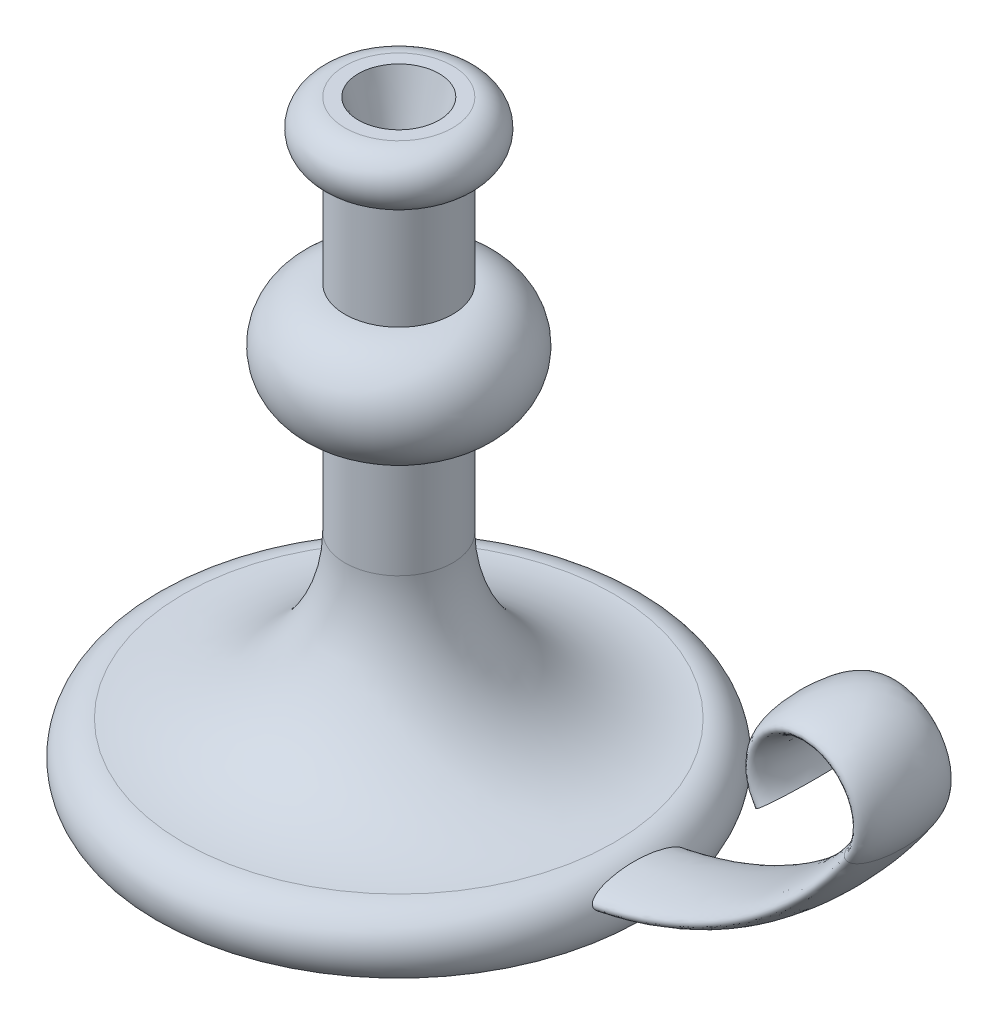
ISO-10303-21;
HEADER;
FILE_DESCRIPTION(('STEP AP214'),'2;1');
FILE_NAME('part.step','',(''),(''),'','','');
FILE_SCHEMA(('AUTOMOTIVE_DESIGN { 1 0 10303 214 1 1 1 1 }'));
ENDSEC;
DATA;
#1=APPLICATION_CONTEXT('core data for automotive mechanical design processes');
#2=APPLICATION_PROTOCOL_DEFINITION('international standard','automotive_design',2000,#1);
#3=PRODUCT_CONTEXT('',#1,'mechanical');
#4=PRODUCT('Part','Part','',(#3));
#5=PRODUCT_RELATED_PRODUCT_CATEGORY('part','',(#4));
#6=PRODUCT_DEFINITION_FORMATION('','',#4);
#7=PRODUCT_DEFINITION_CONTEXT('part definition',#1,'design');
#8=PRODUCT_DEFINITION('design','',#6,#7);
#9=PRODUCT_DEFINITION_SHAPE('','',#8);
#10=(LENGTH_UNIT() NAMED_UNIT(*) SI_UNIT(.MILLI.,.METRE.));
#11=(NAMED_UNIT(*) PLANE_ANGLE_UNIT() SI_UNIT($,.RADIAN.));
#12=(NAMED_UNIT(*) SI_UNIT($,.STERADIAN.) SOLID_ANGLE_UNIT());
#13=UNCERTAINTY_MEASURE_WITH_UNIT(LENGTH_MEASURE(1.E-05),#10,'distance_accuracy_value','');
#14=(GEOMETRIC_REPRESENTATION_CONTEXT(3) GLOBAL_UNCERTAINTY_ASSIGNED_CONTEXT((#13)) GLOBAL_UNIT_ASSIGNED_CONTEXT((#10,
#11,#12)) REPRESENTATION_CONTEXT('',''));
#15=CARTESIAN_POINT('',(0.,0.,0.));
#16=DIRECTION('',(0.,0.,1.));
#17=DIRECTION('',(1.,0.,0.));
#18=AXIS2_PLACEMENT_3D('',#15,#16,#17);
#19=CARTESIAN_POINT('',(0.,0.,0.));
#20=DIRECTION('',(0.,1.,0.));
#21=DIRECTION('',(0.,0.,1.));
#22=AXIS2_PLACEMENT_3D('',#19,#20,#21);
#23=PLANE('',#22);
#24=CARTESIAN_POINT('',(0.,0.,0.));
#25=DIRECTION('',(0.,1.,0.));
#26=DIRECTION('',(0.,0.,1.));
#27=AXIS2_PLACEMENT_3D('',#24,#25,#26);
#28=CIRCLE('',#27,90.);
#29=CARTESIAN_POINT('',(0.,0.,90.));
#30=VERTEX_POINT('',#29);
#31=EDGE_CURVE('E63',#30,#30,#28,.T.);
#32=ORIENTED_EDGE('',*,*,#31,.F.);
#33=EDGE_LOOP('',(#32));
#34=FACE_BOUND('',#33,.T.);
#35=ADVANCED_FACE('F33',(#34),#23,.F.);
#36=CARTESIAN_POINT('',(0.,220.,0.));
#37=DIRECTION('',(0.,-1.,0.));
#38=DIRECTION('',(0.,0.,-1.));
#39=AXIS2_PLACEMENT_3D('',#36,#37,#38);
#40=PLANE('',#39);
#41=CARTESIAN_POINT('',(0.,220.,0.));
#42=DIRECTION('',(0.,1.,0.));
#43=DIRECTION('',(0.,0.,1.));
#44=AXIS2_PLACEMENT_3D('',#41,#42,#43);
#45=CIRCLE('',#44,15.);
#46=CARTESIAN_POINT('',(0.,220.,15.));
#47=VERTEX_POINT('',#46);
#48=EDGE_CURVE('E75',#47,#47,#45,.T.);
#49=ORIENTED_EDGE('',*,*,#48,.F.);
#50=EDGE_LOOP('',(#49));
#51=FACE_BOUND('',#50,.T.);
#52=CARTESIAN_POINT('',(0.,220.,0.));
#53=DIRECTION('',(0.,1.,0.));
#54=DIRECTION('',(0.,0.,1.));
#55=AXIS2_PLACEMENT_3D('',#52,#53,#54);
#56=CIRCLE('',#55,20.);
#57=CARTESIAN_POINT('',(0.,220.,20.));
#58=VERTEX_POINT('',#57);
#59=EDGE_CURVE('E10',#58,#58,#56,.T.);
#60=ORIENTED_EDGE('',*,*,#59,.T.);
#61=EDGE_LOOP('',(#60));
#62=FACE_BOUND('',#61,.T.);
#63=ADVANCED_FACE('F81',(#51,#62),#40,.F.);
#64=CARTESIAN_POINT('',(0.,210.,0.));
#65=DIRECTION('',(0.,1.,0.));
#66=DIRECTION('',(0.,0.,1.));
#67=AXIS2_PLACEMENT_3D('',#64,#65,#66);
#68=TOROIDAL_SURFACE('',#67,20.,10.);
#69=ORIENTED_EDGE('',*,*,#59,.F.);
#70=EDGE_LOOP('',(#69));
#71=FACE_BOUND('',#70,.T.);
#72=CARTESIAN_POINT('',(0.,200.,0.));
#73=DIRECTION('',(0.,1.,0.));
#74=DIRECTION('',(0.,0.,1.));
#75=AXIS2_PLACEMENT_3D('',#72,#73,#74);
#76=CIRCLE('',#75,20.);
#77=CARTESIAN_POINT('',(0.,200.,20.));
#78=VERTEX_POINT('',#77);
#79=EDGE_CURVE('E45',#78,#78,#76,.T.);
#80=ORIENTED_EDGE('',*,*,#79,.T.);
#81=EDGE_LOOP('',(#80));
#82=FACE_BOUND('',#81,.T.);
#83=ADVANCED_FACE('F83',(#71,#82),#68,.T.);
#84=CARTESIAN_POINT('',(0.,0.,0.));
#85=DIRECTION('',(0.,1.,0.));
#86=DIRECTION('',(0.,0.,1.));
#87=AXIS2_PLACEMENT_3D('',#84,#85,#86);
#88=CYLINDRICAL_SURFACE('',#87,20.);
#89=ORIENTED_EDGE('',*,*,#79,.F.);
#90=EDGE_LOOP('',(#89));
#91=FACE_BOUND('',#90,.T.);
#92=CARTESIAN_POINT('',(0.,160.,0.));
#93=DIRECTION('',(0.,1.,0.));
#94=DIRECTION('',(0.,0.,1.));
#95=AXIS2_PLACEMENT_3D('',#92,#93,#94);
#96=CIRCLE('',#95,20.);
#97=CARTESIAN_POINT('',(0.,160.,20.));
#98=VERTEX_POINT('',#97);
#99=EDGE_CURVE('E49',#98,#98,#96,.T.);
#100=ORIENTED_EDGE('',*,*,#99,.T.);
#101=EDGE_LOOP('',(#100));
#102=FACE_BOUND('',#101,.T.);
#103=ADVANCED_FACE('F89',(#91,#102),#88,.T.);
#104=CARTESIAN_POINT('',(0.,140.,0.));
#105=DIRECTION('',(0.,1.,0.));
#106=DIRECTION('',(0.,0.,1.));
#107=AXIS2_PLACEMENT_3D('',#104,#105,#106);
#108=TOROIDAL_SURFACE('',#107,20.,20.);
#109=ORIENTED_EDGE('',*,*,#99,.F.);
#110=EDGE_LOOP('',(#109));
#111=FACE_BOUND('',#110,.T.);
#112=CARTESIAN_POINT('',(0.,120.,0.));
#113=DIRECTION('',(0.,1.,0.));
#114=DIRECTION('',(0.,0.,1.));
#115=AXIS2_PLACEMENT_3D('',#112,#113,#114);
#116=CIRCLE('',#115,20.);
#117=CARTESIAN_POINT('',(0.,120.,20.));
#118=VERTEX_POINT('',#117);
#119=EDGE_CURVE('E54',#118,#118,#116,.T.);
#120=ORIENTED_EDGE('',*,*,#119,.T.);
#121=EDGE_LOOP('',(#120));
#122=FACE_BOUND('',#121,.T.);
#123=ADVANCED_FACE('F97',(#111,#122),#108,.T.);
#124=CARTESIAN_POINT('',(0.,0.,0.));
#125=DIRECTION('',(0.,1.,0.));
#126=DIRECTION('',(0.,0.,1.));
#127=AXIS2_PLACEMENT_3D('',#124,#125,#126);
#128=CYLINDRICAL_SURFACE('',#127,20.);
#129=ORIENTED_EDGE('',*,*,#119,.F.);
#130=EDGE_LOOP('',(#129));
#131=FACE_BOUND('',#130,.T.);
#132=CARTESIAN_POINT('',(0.,80.,0.));
#133=DIRECTION('',(0.,1.,0.));
#134=DIRECTION('',(0.,0.,1.));
#135=AXIS2_PLACEMENT_3D('',#132,#133,#134);
#136=CIRCLE('',#135,20.);
#137=CARTESIAN_POINT('',(0.,80.,20.));
#138=VERTEX_POINT('',#137);
#139=EDGE_CURVE('E57',#138,#138,#136,.T.);
#140=ORIENTED_EDGE('',*,*,#139,.T.);
#141=EDGE_LOOP('',(#140));
#142=FACE_BOUND('',#141,.T.);
#143=ADVANCED_FACE('F101',(#131,#142),#128,.T.);
#144=CARTESIAN_POINT('',(0.,80.,0.));
#145=DIRECTION('',(0.,1.,0.));
#146=DIRECTION('',(0.,0.,1.));
#147=AXIS2_PLACEMENT_3D('',#144,#145,#146);
#148=TOROIDAL_SURFACE('',#147,80.,60.);
#149=ORIENTED_EDGE('',*,*,#139,.F.);
#150=EDGE_LOOP('',(#149));
#151=FACE_BOUND('',#150,.T.);
#152=CARTESIAN_POINT('',(0.,20.,0.));
#153=DIRECTION('',(0.,1.,0.));
#154=DIRECTION('',(0.,0.,1.));
#155=AXIS2_PLACEMENT_3D('',#152,#153,#154);
#156=CIRCLE('',#155,80.);
#157=CARTESIAN_POINT('',(0.,20.,80.));
#158=VERTEX_POINT('',#157);
#159=EDGE_CURVE('E60',#158,#158,#156,.T.);
#160=ORIENTED_EDGE('',*,*,#159,.T.);
#161=EDGE_LOOP('',(#160));
#162=FACE_BOUND('',#161,.T.);
#163=ADVANCED_FACE('F105',(#151,#162),#148,.F.);
#164=CARTESIAN_POINT('',(0.,7.49999999999999,0.));
#165=DIRECTION('',(0.,1.,0.));
#166=DIRECTION('',(0.,0.,1.));
#167=AXIS2_PLACEMENT_3D('',#164,#165,#166);
#168=TOROIDAL_SURFACE('',#167,80.,12.5);
#169=CARTESIAN_POINT('',(89.5597422043342,12.9414346567555,-17.5));
#170=CARTESIAN_POINT('',(89.5807278946485,12.8988393157081,-17.5000019534777));
#171=CARTESIAN_POINT('',(89.6018125795404,12.8563039357769,-17.4977816975197));
#172=CARTESIAN_POINT('',(89.6440155813562,12.771693833937,-17.489002543543));
#173=CARTESIAN_POINT('',(89.6651339056646,12.7296192360718,-17.4824425050804));
#174=CARTESIAN_POINT('',(89.7283289297819,12.6045076597417,-17.4565216692094));
#175=CARTESIAN_POINT('',(89.7702246464786,12.5226255894255,-17.4309204730636));
#176=CARTESIAN_POINT('',(89.8644276523312,12.3407735771966,-17.3563532007827));
#177=CARTESIAN_POINT('',(89.9162117483189,12.242484901666,-17.3027527423027));
#178=CARTESIAN_POINT('',(90.01638786814,12.0551458272008,-17.178826321144));
#179=CARTESIAN_POINT('',(90.0647710548456,11.966119226993,-17.1084587296403));
#180=CARTESIAN_POINT('',(90.1524531790238,11.8069845229249,-16.9652391551481));
#181=CARTESIAN_POINT('',(90.1921458014336,11.7358878994478,-16.8936963434585));
#182=CARTESIAN_POINT('',(90.2690886261224,11.5996259068224,-16.7438969488311));
#183=CARTESIAN_POINT('',(90.3063367280021,11.5344656201532,-16.665634722265));
#184=CARTESIAN_POINT('',(90.3786756485819,11.4092540815105,-16.5039763875564));
#185=CARTESIAN_POINT('',(90.4137624747614,11.349212210629,-16.4205713158719));
#186=CARTESIAN_POINT('',(90.4819450166471,11.2336894025401,-16.2499454917114));
#187=CARTESIAN_POINT('',(90.5150413047902,11.1782071523834,-16.162725848809));
#188=CARTESIAN_POINT('',(90.5839705930101,11.0637251825689,-15.9728919395736));
#189=CARTESIAN_POINT('',(90.6195406839563,11.0053156128849,-15.8698282905887));
#190=CARTESIAN_POINT('',(90.6886668526269,10.8929143897208,-15.6606649910658));
#191=CARTESIAN_POINT('',(90.7222226971282,10.8389232475745,-15.5545649910506));
#192=CARTESIAN_POINT('',(90.7874864861339,10.7348751403119,-15.3401290691865));
#193=CARTESIAN_POINT('',(90.8191972688173,10.6848120890841,-15.2317969483067));
#194=CARTESIAN_POINT('',(90.881005962979,10.5880683385414,-15.0131968985225));
#195=CARTESIAN_POINT('',(90.9111039714557,10.5413874357516,-14.9029290865686));
#196=CARTESIAN_POINT('',(90.9798973633521,10.4355491517098,-14.6427529331226));
#197=CARTESIAN_POINT('',(91.0180072010883,10.377593665576,-14.492201207548));
#198=CARTESIAN_POINT('',(91.0918875553169,10.2663462891691,-14.1888070722871));
#199=CARTESIAN_POINT('',(91.1276577411367,10.2130550577559,-14.0359643425397));
#200=CARTESIAN_POINT('',(91.1971197458645,10.1105127689612,-13.7282685712581));
#201=CARTESIAN_POINT('',(91.2308091946811,10.0612662985098,-13.573413471871));
#202=CARTESIAN_POINT('',(91.2962483962878,9.96642044574796,-13.262180104172));
#203=CARTESIAN_POINT('',(91.3279980241889,9.9208212981999,-13.1058017385396));
#204=CARTESIAN_POINT('',(91.4205951755327,9.78887458660796,-12.6346162266684));
#205=CARTESIAN_POINT('',(91.4787589060981,9.70742476979592,-12.3179025042442));
#206=CARTESIAN_POINT('',(91.5890957852254,9.55493826130149,-11.6792188898601));
#207=CARTESIAN_POINT('',(91.641236506382,9.48395741425904,-11.3572303186109));
#208=CARTESIAN_POINT('',(91.7397682682944,9.35136221163195,-10.7107316640822));
#209=CARTESIAN_POINT('',(91.7861636672357,9.28974074823244,-10.3862236929833));
#210=CARTESIAN_POINT('',(91.8736976604511,9.17463718318051,-9.73512886653562));
#211=CARTESIAN_POINT('',(91.9148370779327,9.12115380666534,-9.40854234516807));
#212=CARTESIAN_POINT('',(91.9930777751443,9.02031209920315,-8.74630339912605));
#213=CARTESIAN_POINT('',(92.0300669877613,8.97311921137157,-8.41061269264328));
#214=CARTESIAN_POINT('',(92.0991833927575,8.88559842477432,-7.73783252743936));
#215=CARTESIAN_POINT('',(92.1313104056235,8.8452707794675,-7.40074301754602));
#216=CARTESIAN_POINT('',(92.1909161961866,8.77092313439267,-6.72537142355336));
#217=CARTESIAN_POINT('',(92.2183937480205,8.73690479789181,-6.38708904887181));
#218=CARTESIAN_POINT('',(92.2688480816039,8.674768403045,-5.7096442777428));
#219=CARTESIAN_POINT('',(92.2918247141674,8.64665054027192,-5.37048185250289));
#220=CARTESIAN_POINT('',(92.3540877228586,8.57076604630486,-4.35367181244658));
#221=CARTESIAN_POINT('',(92.3868571977359,8.53128338370554,-3.67498389641636));
#222=CARTESIAN_POINT('',(92.4356134743347,8.47274161832895,-2.31614711504058));
#223=CARTESIAN_POINT('',(92.4515998737813,8.45368300509715,-1.63599821506812));
#224=CARTESIAN_POINT('',(92.4661200478781,8.43637339284854,-0.357955102331839));
#225=CARTESIAN_POINT('',(92.4665389208555,8.43587490179707,0.239888856143747));
#226=CARTESIAN_POINT('',(92.4546362797528,8.4500624126083,1.4353615385917));
#227=CARTESIAN_POINT('',(92.4423128974783,8.46475064105844,2.03299021814846));
#228=CARTESIAN_POINT('',(92.4047541650815,8.50976680779929,3.22745109478545));
#229=CARTESIAN_POINT('',(92.379514731688,8.54009969200437,3.82428298010724));
#230=CARTESIAN_POINT('',(92.3157217367252,8.61743320229675,5.01694606233257));
#231=CARTESIAN_POINT('',(92.2771508465328,8.66445552395918,5.61277493756125));
#232=CARTESIAN_POINT('',(92.1861026743767,8.77678784246254,6.80153886380931));
#233=CARTESIAN_POINT('',(92.1336290020919,8.84209309262497,7.3944746253508));
#234=CARTESIAN_POINT('',(92.0437550848419,8.95574227206709,8.280552298205));
#235=CARTESIAN_POINT('',(92.0119455213755,8.99622894552012,8.57528682166713));
#236=CARTESIAN_POINT('',(91.9444204496405,9.08291539794886,9.16346094428869));
#237=CARTESIAN_POINT('',(91.9087051114865,9.12911492811455,9.45690059926699));
#238=CARTESIAN_POINT('',(91.8331309715698,9.22782929334065,10.0422906036682));
#239=CARTESIAN_POINT('',(91.7932707518514,9.28034629056378,10.3342404073466));
#240=CARTESIAN_POINT('',(91.709117916737,9.39245062081626,10.916185281105));
#241=CARTESIAN_POINT('',(91.6648247441272,9.45203884286026,11.206180100545));
#242=CARTESIAN_POINT('',(91.5713925727481,9.57931645333874,11.7838191658166));
#243=CARTESIAN_POINT('',(91.5222504482682,9.64701107336918,12.071461764307));
#244=CARTESIAN_POINT('',(91.4186796874406,9.79172730085898,12.6430805537629));
#245=CARTESIAN_POINT('',(91.3642572573635,9.86873798424087,12.9270606150352));
#246=CARTESIAN_POINT('',(91.2493765391175,10.0339529747879,13.4904217181463));
#247=CARTESIAN_POINT('',(91.1889212109098,10.1221517983453,13.7698049377445));
#248=CARTESIAN_POINT('',(91.0929373870874,10.2648274882362,14.1839125047643));
#249=CARTESIAN_POINT('',(91.0600757486262,10.3140904181848,14.3210581267384));
#250=CARTESIAN_POINT('',(90.9923938569387,10.4165511027191,14.5933763477646));
#251=CARTESIAN_POINT('',(90.9575737807137,10.4697485018482,14.7285491237341));
#252=CARTESIAN_POINT('',(90.8810851838777,10.5878451344078,15.0138774923675));
#253=CARTESIAN_POINT('',(90.8391147723957,10.6533666208411,15.1636969104746));
#254=CARTESIAN_POINT('',(90.7519625692612,10.7912189771814,15.4593295355899));
#255=CARTESIAN_POINT('',(90.7067794219569,10.8635527258307,15.6051410149848));
#256=CARTESIAN_POINT('',(90.6128939496975,11.0160439629677,15.8905749729622));
#257=CARTESIAN_POINT('',(90.5642084544311,11.0961646105685,16.0302224467125));
#258=CARTESIAN_POINT('',(90.4624897667353,11.2662530107873,16.3016394850687));
#259=CARTESIAN_POINT('',(90.4094613083908,11.3562100760682,16.4334173639364));
#260=CARTESIAN_POINT('',(90.3114276481005,11.5255085385048,16.655310813896));
#261=CARTESIAN_POINT('',(90.2675273757817,11.6022608890606,16.7478644471361));
#262=CARTESIAN_POINT('',(90.1761749534326,11.7643292238687,16.9236630994732));
#263=CARTESIAN_POINT('',(90.1287172073378,11.849658775493,17.0068929161981));
#264=CARTESIAN_POINT('',(90.0292807633426,12.0313291797368,17.160728121925));
#265=CARTESIAN_POINT('',(89.9772518064337,12.1277974407354,17.2311575389091));
#266=CARTESIAN_POINT('',(89.8965437818878,12.2800613987941,17.3212876850735));
#267=CARTESIAN_POINT('',(89.8692277989253,12.3320164153136,17.3487242132161));
#268=CARTESIAN_POINT('',(89.8138320311432,12.4382955168477,17.3975211145679));
#269=CARTESIAN_POINT('',(89.7857527202502,12.4926181439797,17.418885167671));
#270=CARTESIAN_POINT('',(89.7185869780336,12.6237048005598,17.4611772226903));
#271=CARTESIAN_POINT('',(89.6792533408887,12.7013692224275,17.4790502108363));
#272=CARTESIAN_POINT('',(89.6005512815565,12.8586256339484,17.4997317533412));
#273=CARTESIAN_POINT('',(89.5611829132234,12.9382160139948,17.5025524785485));
#274=CARTESIAN_POINT('',(89.4835317885698,13.0969633423243,17.4927372657774));
#275=CARTESIAN_POINT('',(89.4452490812937,13.1761202708963,17.4801006306501));
#276=CARTESIAN_POINT('',(89.3707047667355,13.3318071774562,17.440649407729));
#277=CARTESIAN_POINT('',(89.3344452993772,13.408334342353,17.413820111618));
#278=CARTESIAN_POINT('',(89.2510611220235,13.5858554385681,17.3357126521073));
#279=CARTESIAN_POINT('',(89.2050998650832,13.6849823777219,17.2790047620842));
#280=CARTESIAN_POINT('',(89.1180744174557,13.8744276311818,17.1491670423827));
#281=CARTESIAN_POINT('',(89.077030105826,13.9647099356685,17.0759737821299));
#282=CARTESIAN_POINT('',(89.0037033744712,14.1271434857569,16.9270577307041));
#283=CARTESIAN_POINT('',(88.9709541551904,14.200194568073,16.8525208708988));
#284=CARTESIAN_POINT('',(88.9084968426191,14.3401811690447,16.6970292692113));
#285=CARTESIAN_POINT('',(88.8787841266135,14.4071259665768,16.6160846261895));
#286=CARTESIAN_POINT('',(88.821781438855,14.5359995630881,16.4490709627681));
#287=CARTESIAN_POINT('',(88.7944998605827,14.597910924241,16.3629857823213));
#288=CARTESIAN_POINT('',(88.742066743737,14.7171734064658,16.1870697873634));
#289=CARTESIAN_POINT('',(88.7169159331093,14.7745229686599,16.0972377082954));
#290=CARTESIAN_POINT('',(88.6682699235337,14.885589909051,15.9140699306466));
#291=CARTESIAN_POINT('',(88.6447869137157,14.9392804489424,15.8207148279063));
#292=CARTESIAN_POINT('',(88.5993971939428,15.043100884388,15.6316626961438));
#293=CARTESIAN_POINT('',(88.5774907604159,15.09323015551,15.5359652603529));
#294=CARTESIAN_POINT('',(88.5137514786221,15.2390285874184,15.2458062448793));
#295=CARTESIAN_POINT('',(88.4739596847914,15.3299685477357,15.0485147207853));
#296=CARTESIAN_POINT('',(88.3985337506616,15.5017775203623,14.6487152633395));
#297=CARTESIAN_POINT('',(88.3629029634841,15.5826384140038,14.4462032813481));
#298=CARTESIAN_POINT('',(88.2948356711213,15.7363066128669,14.0365764701698));
#299=CARTESIAN_POINT('',(88.262414229517,15.8090761199813,13.8294450545359));
#300=CARTESIAN_POINT('',(88.2003835751383,15.9473648801954,13.412628987177));
#301=CARTESIAN_POINT('',(88.1707714189815,16.012891733822,13.2029472733592));
#302=CARTESIAN_POINT('',(88.1139049361939,16.1377375745618,12.7814949946311));
#303=CARTESIAN_POINT('',(88.0866500408509,16.1970580597501,12.5697249473639));
#304=CARTESIAN_POINT('',(88.0276172572031,16.3244235662302,12.0912931700789));
#305=CARTESIAN_POINT('',(87.9964138193045,16.3909381265492,11.8241540502356));
#306=CARTESIAN_POINT('',(87.9367717636618,16.5165936764717,11.2878278414661));
#307=CARTESIAN_POINT('',(87.9083334164423,16.5757339447658,11.0186405549286));
#308=CARTESIAN_POINT('',(87.8539266282973,16.6875098948954,10.4785408424896));
#309=CARTESIAN_POINT('',(87.8279593730488,16.7401424577993,10.2076276543206));
#310=CARTESIAN_POINT('',(87.7783184309333,16.8395301522934,9.66451167999969));
#311=CARTESIAN_POINT('',(87.7546448506397,16.8862850108115,9.39230883454069));
#312=CARTESIAN_POINT('',(87.6869994555326,17.0182803050946,8.57578965921947));
#313=CARTESIAN_POINT('',(87.6462388525848,17.0955854003685,8.0299116722562));
#314=CARTESIAN_POINT('',(87.5728065515612,17.23201456873,6.93552385094184));
#315=CARTESIAN_POINT('',(87.5401330675684,17.2911426566326,6.38701462498281));
#316=CARTESIAN_POINT('',(87.4828441952972,17.3930876120973,5.28955884851114));
#317=CARTESIAN_POINT('',(87.4582074588682,17.4359477429321,4.74061740412776));
#318=CARTESIAN_POINT('',(87.4169410999173,17.50688849347,3.64146108218984));
#319=CARTESIAN_POINT('',(87.4003119088603,17.5349683167838,3.09124613762086));
#320=CARTESIAN_POINT('',(87.375169948199,17.5771566462024,1.98980868969536));
#321=CARTESIAN_POINT('',(87.3666614689744,17.5912577671531,1.43858580772459));
#322=CARTESIAN_POINT('',(87.3578539704596,17.6058511840595,0.335909067649123));
#323=CARTESIAN_POINT('',(87.3575547550007,17.6063438052041,-0.2155447846214));
#324=CARTESIAN_POINT('',(87.3651677510508,17.5937352162514,-1.31815822775828));
#325=CARTESIAN_POINT('',(87.3730787250643,17.5806360547997,-1.86931785044668));
#326=CARTESIAN_POINT('',(87.3970372477741,17.5404868292748,-2.97097544677276));
#327=CARTESIAN_POINT('',(87.4130850653536,17.5134363041763,-3.5214733979428));
#328=CARTESIAN_POINT('',(87.4531996813079,17.4446213827579,-4.62112135666312));
#329=CARTESIAN_POINT('',(87.4772644593789,17.4028606933023,-5.17027166873653));
#330=CARTESIAN_POINT('',(87.5333316774058,17.3033707612736,-6.26670053623022));
#331=CARTESIAN_POINT('',(87.5653334299479,17.2456429015522,-6.81397924958862));
#332=CARTESIAN_POINT('',(87.6208220531228,17.1429049509091,-7.65503321383248));
#333=CARTESIAN_POINT('',(87.6414679669256,17.1042333246747,-7.94978028808389));
#334=CARTESIAN_POINT('',(87.6851649593453,17.0212250701561,-8.53829462761755));
#335=CARTESIAN_POINT('',(87.7082159678747,16.9768886069434,-8.83206192119445));
#336=CARTESIAN_POINT('',(87.7568106691334,16.8820510369686,-9.41827197236465));
#337=CARTESIAN_POINT('',(87.7823533405998,16.8315524537752,-9.71071522164428));
#338=CARTESIAN_POINT('',(87.8360989952262,16.7237193681056,-10.2940938312713));
#339=CARTESIAN_POINT('',(87.8643018909553,16.6663850902748,-10.585029240844));
#340=CARTESIAN_POINT('',(87.9147712499544,16.5622842610512,-11.078452988719));
#341=CARTESIAN_POINT('',(87.9362980252951,16.5174691899797,-11.2814293835303));
#342=CARTESIAN_POINT('',(87.98091183013,16.4236835134758,-11.6862455623045));
#343=CARTESIAN_POINT('',(88.003998812335,16.374713033981,-11.8880853805162));
#344=CARTESIAN_POINT('',(88.051919824494,16.2721215384767,-12.2905621648816));
#345=CARTESIAN_POINT('',(88.0767553337321,16.2184965755437,-12.4911979528386));
#346=CARTESIAN_POINT('',(88.1283787004664,16.1060707847346,-12.8907612736812));
#347=CARTESIAN_POINT('',(88.1551664933019,16.0472701282671,-13.0896888628995));
#348=CARTESIAN_POINT('',(88.21099997805,15.9237718205584,-13.4854201231387));
#349=CARTESIAN_POINT('',(88.2400459194855,15.8590735174972,-13.6822235566987));
#350=CARTESIAN_POINT('',(88.3008027999429,15.722869193586,-14.0730419872875));
#351=CARTESIAN_POINT('',(88.3325134779581,15.6513638393852,-14.2670572552379));
#352=CARTESIAN_POINT('',(88.3991424541956,15.5003948115867,-14.6511973591117));
#353=CARTESIAN_POINT('',(88.4340575115813,15.4209391715434,-14.8413258930641));
#354=CARTESIAN_POINT('',(88.5079196083045,15.2523848762573,-15.2164401400152));
#355=CARTESIAN_POINT('',(88.5468648114126,15.1632906117658,-15.4014281468474));
#356=CARTESIAN_POINT('',(88.6092096238848,15.0206579718878,-15.6733114229628));
#357=CARTESIAN_POINT('',(88.6306485895098,14.9716086740033,-15.7630166800357));
#358=CARTESIAN_POINT('',(88.6750422753309,14.8701248615228,-15.9401002079361));
#359=CARTESIAN_POINT('',(88.6979967332494,14.8176909327206,-16.0274788777588));
#360=CARTESIAN_POINT('',(88.7456840101796,14.708947884428,-16.1993887567124));
#361=CARTESIAN_POINT('',(88.7704179688268,14.6526362825898,-16.2839180892534));
#362=CARTESIAN_POINT('',(88.8219484857477,14.535642261791,-16.4492391224747));
#363=CARTESIAN_POINT('',(88.8487445345046,14.4749609227749,-16.5300317386025));
#364=CARTESIAN_POINT('',(88.8976102788186,14.3647434848953,-16.6667168433045));
#365=CARTESIAN_POINT('',(88.9191374191608,14.3163230322084,-16.723695533494));
#366=CARTESIAN_POINT('',(88.9637080676467,14.2164452982163,-16.8342912802669));
#367=CARTESIAN_POINT('',(88.9867519478512,14.1649872721067,-16.8879075056812));
#368=CARTESIAN_POINT('',(89.0583610181499,14.0058008216802,-17.0423310846551));
#369=CARTESIAN_POINT('',(89.1095289234102,13.8929758416962,-17.137079610972));
#370=CARTESIAN_POINT('',(89.1999001554573,13.696338620898,-17.2707956184661));
#371=CARTESIAN_POINT('',(89.236750516932,13.6167644879688,-17.3175503480627));
#372=CARTESIAN_POINT('',(89.3136877653848,13.4522974166017,-17.3968468737184));
#373=CARTESIAN_POINT('',(89.3537667767863,13.367417527397,-17.4294220837179));
#374=CARTESIAN_POINT('',(89.4217091217891,13.2251848973546,-17.4685967336682));
#375=CARTESIAN_POINT('',(89.4488093840978,13.168855171618,-17.4803204652975));
#376=CARTESIAN_POINT('',(89.5037947740348,13.0554594934973,-17.4960211898048));
#377=CARTESIAN_POINT('',(89.5316799818999,12.9983934661742,-17.499997387795));
#378=CARTESIAN_POINT('',(89.5597422043342,12.9414346567555,-17.5));
#379=B_SPLINE_CURVE_WITH_KNOTS('',3,(#169,#170,#171,#172,#173,#174,#175,#176,#177,#178,#179,
#180,#181,#182,#183,#184,#185,#186,#187,#188,#189,#190,#191,#192,#193,#194,#195,#196,#197,#198,
#199,#200,#201,#202,#203,#204,#205,#206,#207,#208,#209,#210,#211,#212,#213,#214,#215,#216,#217,
#218,#219,#220,#221,#222,#223,#224,#225,#226,#227,#228,#229,#230,#231,#232,#233,#234,#235,#236,
#237,#238,#239,#240,#241,#242,#243,#244,#245,#246,#247,#248,#249,#250,#251,#252,#253,#254,#255,
#256,#257,#258,#259,#260,#261,#262,#263,#264,#265,#266,#267,#268,#269,#270,#271,#272,#273,#274,
#275,#276,#277,#278,#279,#280,#281,#282,#283,#284,#285,#286,#287,#288,#289,#290,#291,#292,#293,
#294,#295,#296,#297,#298,#299,#300,#301,#302,#303,#304,#305,#306,#307,#308,#309,#310,#311,#312,
#313,#314,#315,#316,#317,#318,#319,#320,#321,#322,#323,#324,#325,#326,#327,#328,#329,#330,#331,
#332,#333,#334,#335,#336,#337,#338,#339,#340,#341,#342,#343,#344,#345,#346,#347,#348,#349,#350,
#351,#352,#353,#354,#355,#356,#357,#358,#359,#360,#361,#362,#363,#364,#365,#366,#367,#368,#369,
#370,#371,#372,#373,#374,#375,#376,#377,#378),.UNSPECIFIED.,.T.,.F.,(4,2,2,2,2,2,2,2,2,2,2,2,2,
2,2,2,2,2,2,2,2,2,2,2,2,2,2,2,2,2,2,2,2,2,2,2,2,2,2,2,2,2,2,2,2,2,2,2,2,2,2,2,2,2,2,2,2,2,2,2,2,
2,2,2,2,2,2,2,2,2,2,2,2,2,2,2,2,2,2,2,2,2,2,2,2,2,2,2,2,2,2,2,2,2,2,2,2,2,2,2,2,2,2,2,4),(0.,
0.142381357158824,0.284800145338814,0.569778369710406,0.937790990160525,1.30672699797604,
1.63143353328554,1.95641550824171,2.28198085179476,2.60745211744531,2.97835758825749,
3.34930592253145,3.71966767593577,4.09000712931068,4.58717127025781,5.08440552627607,
5.58219609730425,6.0800186832221,7.07612740491155,8.07737111401425,9.07785060328487,
10.0781732018631,11.1010679437463,12.124000441837,13.1472022244408,14.1704379160044,
16.2117115539475,18.2530341182274,20.046245769242,21.8397203676841,23.6337623045227,
25.4301450150664,27.2260617741973,28.1235892294176,29.0210776087002,29.9188740333845,
30.816783451432,31.7152755049918,32.6127240115715,33.5097343419001,33.9578247270812,
34.4058746792326,34.9121604747936,35.4186611861168,35.9228725276492,36.4265413835619,
36.8100240505596,37.1941231504199,37.5831580539591,37.7772586450041,37.9712413599167,
38.2366258142316,38.5017956533799,38.7669774525069,39.0324346081147,39.3996555983547,
39.7683144393119,40.0959866375237,40.4231523204125,40.7514069982209,41.0797733710073,
41.4103344436375,41.7409533344648,42.4030339566264,43.0656444835725,43.7312306850942,
44.3961116446145,45.0608317450492,45.8918608553065,46.7229711882485,47.554478313974,
48.3860240564132,50.0440426041155,51.7016946762987,53.3549069476158,55.0082082878421,
56.66238262673,58.3165174374141,59.9704029618881,61.6243431428158,63.2778668395586,
64.9312473761617,65.825161771736,66.719050124865,67.6125736254172,68.5060677696803,
69.1329546330635,69.7598225042264,70.3872272415065,71.0146112082189,71.6420645989491,
72.2694566030637,72.8962209263431,73.5227009279498,73.8360175198378,74.1492800292287,
74.4627449766586,74.7761327179486,75.0094189443185,75.2427626113335,75.708018639221,
76.0052441465106,76.3017654013234,76.4921392885515,76.6825327068869),.UNSPECIFIED.);
#380=CARTESIAN_POINT('',(89.5597422043342,12.9414346567555,-17.5));
#381=VERTEX_POINT('',#380);
#382=EDGE_CURVE('E36',#381,#381,#379,.T.);
#383=ORIENTED_EDGE('',*,*,#382,.T.);
#384=EDGE_LOOP('',(#383));
#385=FACE_BOUND('',#384,.T.);
#386=ORIENTED_EDGE('',*,*,#159,.F.);
#387=EDGE_LOOP('',(#386));
#388=FACE_BOUND('',#387,.T.);
#389=ORIENTED_EDGE('',*,*,#31,.T.);
#390=EDGE_LOOP('',(#389));
#391=FACE_BOUND('',#390,.T.);
#392=ADVANCED_FACE('F108',(#385,#388,#391),#168,.T.);
#393=CARTESIAN_POINT('',(60.,10.,-17.5));
#394=CARTESIAN_POINT('',(110.410191303973,10.,-17.5));
#395=CARTESIAN_POINT('',(155.026295870831,33.4646670673665,-17.5));
#396=CARTESIAN_POINT('',(183.592070943083,75.,-17.5));
#397=CARTESIAN_POINT('',(60.,20.,-17.5));
#398=CARTESIAN_POINT('',(107.049511883708,20.,-17.5));
#399=CARTESIAN_POINT('',(148.691209479443,41.9003559295421,-17.5));
#400=CARTESIAN_POINT('',(175.352599546877,80.6666666666666,-17.5));
#401=CARTESIAN_POINT('',(60.,20.,17.5));
#402=CARTESIAN_POINT('',(107.049511883708,20.,17.5));
#403=CARTESIAN_POINT('',(148.691209479443,41.9003559295421,17.5));
#404=CARTESIAN_POINT('',(175.352599546877,80.6666666666666,17.5));
#405=CARTESIAN_POINT('',(60.,10.,17.5));
#406=CARTESIAN_POINT('',(110.410191303973,10.,17.5));
#407=CARTESIAN_POINT('',(155.026295870831,33.4646670673665,17.5));
#408=CARTESIAN_POINT('',(183.592070943083,75.,17.5));
#409=CARTESIAN_POINT('',(60.,0.,17.5));
#410=CARTESIAN_POINT('',(113.770870724238,0.,17.5));
#411=CARTESIAN_POINT('',(161.36138226222,25.0289782051909,17.5));
#412=CARTESIAN_POINT('',(191.831542339288,69.3333333333333,17.5));
#413=CARTESIAN_POINT('',(60.,0.,-17.5));
#414=CARTESIAN_POINT('',(113.770870724238,0.,-17.5));
#415=CARTESIAN_POINT('',(161.36138226222,25.0289782051909,-17.5));
#416=CARTESIAN_POINT('',(191.831542339288,69.3333333333333,-17.5));
#417=CARTESIAN_POINT('',(60.,10.,-17.5));
#418=CARTESIAN_POINT('',(110.410191303973,10.,-17.5));
#419=CARTESIAN_POINT('',(155.026295870831,33.4646670673665,-17.5));
#420=CARTESIAN_POINT('',(183.592070943083,75.,-17.5));
#421=(BOUNDED_SURFACE() B_SPLINE_SURFACE(3,3,((#393,#394,#395,#396),(#397,#398,#399,#400),(#401,
#402,#403,#404),(#405,#406,#407,#408),(#409,#410,#411,#412),(#413,#414,#415,#416),(#417,#418,
#419,#420)),.UNSPECIFIED.,.T.,.F.,.F.) B_SPLINE_SURFACE_WITH_KNOTS((4,3,4),(4,4),(0.,0.5,1.),
(0.,1.),.UNSPECIFIED.) GEOMETRIC_REPRESENTATION_ITEM() RATIONAL_B_SPLINE_SURFACE(((1.,
0.923374135437856,0.923374135437856,1.),(0.333333333333333,0.307791378479285,0.307791378479285,
0.333333333333333),(0.333333333333333,0.307791378479285,0.307791378479285,0.333333333333333),
(1.,0.923374135437856,0.923374135437856,1.),(0.333333333333333,0.307791378479285,
0.307791378479285,0.333333333333333),(0.333333333333333,0.307791378479285,0.307791378479285,
0.333333333333333),(1.,0.923374135437856,0.923374135437856,1.))) REPRESENTATION_ITEM('') SURFACE());
#422=CARTESIAN_POINT('',(183.592070943083,75.,0.));
#423=DIRECTION('',(0.566666666666667,0.823947139620552,0.));
#424=DIRECTION('',(0.,0.,-1.));
#425=AXIS2_PLACEMENT_3D('',#422,#423,#424);
#426=ELLIPSE('',#425,17.5,5.);
#427=CARTESIAN_POINT('',(183.592070943083,75.,-17.5));
#428=VERTEX_POINT('',#427);
#429=EDGE_CURVE('E69',#428,#428,#426,.T.);
#430=ORIENTED_EDGE('',*,*,#429,.F.);
#431=EDGE_LOOP('',(#430));
#432=FACE_BOUND('',#431,.T.);
#433=ORIENTED_EDGE('',*,*,#382,.F.);
#434=EDGE_LOOP('',(#433));
#435=FACE_BOUND('',#434,.T.);
#436=ADVANCED_FACE('F113',(#432,#435),#421,.T.);
#437=CARTESIAN_POINT('',(150.634185358261,75.,0.));
#438=DIRECTION('',(0.566666666666666,-0.823947139620552,0.));
#439=DIRECTION('',(0.,0.,-1.));
#440=AXIS2_PLACEMENT_3D('',#437,#438,#439);
#441=PLANE('',#440);
#442=CARTESIAN_POINT('',(150.634185358261,75.,0.));
#443=DIRECTION('',(0.566666666666666,-0.823947139620552,0.));
#444=DIRECTION('',(0.,0.,-1.));
#445=AXIS2_PLACEMENT_3D('',#442,#443,#444);
#446=ELLIPSE('',#445,17.5,5.);
#447=CARTESIAN_POINT('',(150.634185358261,75.,-17.5));
#448=VERTEX_POINT('',#447);
#449=EDGE_CURVE('E66',#448,#448,#446,.T.);
#450=ORIENTED_EDGE('',*,*,#449,.T.);
#451=EDGE_LOOP('',(#450));
#452=FACE_BOUND('',#451,.T.);
#453=ADVANCED_FACE('F115',(#452),#441,.T.);
#454=CARTESIAN_POINT('',(183.592070943083,75.,-17.5));
#455=CARTESIAN_POINT('',(193.981461744242,90.10642735238,-17.5));
#456=CARTESIAN_POINT('',(185.447347211541,106.333333333333,-17.5));
#457=CARTESIAN_POINT('',(167.113128150672,106.333333333333,-17.5));
#458=CARTESIAN_POINT('',(148.778909089802,106.333333333333,-17.5));
#459=CARTESIAN_POINT('',(140.244794557101,90.1064273523801,-17.5));
#460=CARTESIAN_POINT('',(150.634185358261,75.,-17.5));
#461=CARTESIAN_POINT('',(175.352599546877,80.6666666666667,-17.5));
#462=CARTESIAN_POINT('',(180.547294947457,88.2198803428567,-17.5));
#463=CARTESIAN_POINT('',(176.280237681107,96.3333333333333,-17.5));
#464=CARTESIAN_POINT('',(167.113128150672,96.3333333333333,-17.5));
#465=CARTESIAN_POINT('',(157.946018620237,96.3333333333333,-17.5));
#466=CARTESIAN_POINT('',(153.678961353887,88.2198803428567,-17.5));
#467=CARTESIAN_POINT('',(158.873656754466,80.6666666666667,-17.5));
#468=CARTESIAN_POINT('',(175.352599546877,80.6666666666667,17.5));
#469=CARTESIAN_POINT('',(180.547294947457,88.2198803428567,17.5));
#470=CARTESIAN_POINT('',(176.280237681107,96.3333333333333,17.5));
#471=CARTESIAN_POINT('',(167.113128150672,96.3333333333333,17.5));
#472=CARTESIAN_POINT('',(157.946018620237,96.3333333333333,17.5));
#473=CARTESIAN_POINT('',(153.678961353887,88.2198803428567,17.5));
#474=CARTESIAN_POINT('',(158.873656754466,80.6666666666667,17.5));
#475=CARTESIAN_POINT('',(183.592070943083,75.,17.5));
#476=CARTESIAN_POINT('',(193.981461744242,90.10642735238,17.5));
#477=CARTESIAN_POINT('',(185.447347211541,106.333333333333,17.5));
#478=CARTESIAN_POINT('',(167.113128150672,106.333333333333,17.5));
#479=CARTESIAN_POINT('',(148.778909089802,106.333333333333,17.5));
#480=CARTESIAN_POINT('',(140.244794557101,90.1064273523801,17.5));
#481=CARTESIAN_POINT('',(150.634185358261,75.,17.5));
#482=CARTESIAN_POINT('',(191.831542339288,69.3333333333333,17.5));
#483=CARTESIAN_POINT('',(207.415628541028,91.9929743619034,17.5));
#484=CARTESIAN_POINT('',(194.614456741976,116.333333333333,17.5));
#485=CARTESIAN_POINT('',(167.113128150672,116.333333333333,17.5));
#486=CARTESIAN_POINT('',(139.611799559367,116.333333333333,17.5));
#487=CARTESIAN_POINT('',(126.810627760316,91.9929743619035,17.5));
#488=CARTESIAN_POINT('',(142.394713962055,69.3333333333334,17.5));
#489=CARTESIAN_POINT('',(191.831542339288,69.3333333333333,-17.5));
#490=CARTESIAN_POINT('',(207.415628541028,91.9929743619034,-17.5));
#491=CARTESIAN_POINT('',(194.614456741976,116.333333333333,-17.5));
#492=CARTESIAN_POINT('',(167.113128150672,116.333333333333,-17.5));
#493=CARTESIAN_POINT('',(139.611799559367,116.333333333333,-17.5));
#494=CARTESIAN_POINT('',(126.810627760316,91.9929743619035,-17.5));
#495=CARTESIAN_POINT('',(142.394713962055,69.3333333333334,-17.5));
#496=CARTESIAN_POINT('',(183.592070943083,75.,-17.5));
#497=CARTESIAN_POINT('',(193.981461744242,90.10642735238,-17.5));
#498=CARTESIAN_POINT('',(185.447347211541,106.333333333333,-17.5));
#499=CARTESIAN_POINT('',(167.113128150672,106.333333333333,-17.5));
#500=CARTESIAN_POINT('',(148.778909089802,106.333333333333,-17.5));
#501=CARTESIAN_POINT('',(140.244794557101,90.1064273523801,-17.5));
#502=CARTESIAN_POINT('',(150.634185358261,75.,-17.5));
#503=(BOUNDED_SURFACE() B_SPLINE_SURFACE(3,3,((#454,#455,#456,#457,#458,#459,#460),(#461,#462,
#463,#464,#465,#466,#467),(#468,#469,#470,#471,#472,#473,#474),(#475,#476,#477,#478,#479,#480,
#481),(#482,#483,#484,#485,#486,#487,#488),(#489,#490,#491,#492,#493,#494,#495),(#496,#497,#498,
#499,#500,#501,#502)),.UNSPECIFIED.,.T.,.F.,.F.) B_SPLINE_SURFACE_WITH_KNOTS((4,3,4),(4,3,4),
(0.,0.5,1.),(0.,0.5,1.),
.UNSPECIFIED.) GEOMETRIC_REPRESENTATION_ITEM() RATIONAL_B_SPLINE_SURFACE(((1.,0.643649778750421,
0.643649778750421,1.,0.643649778750421,0.643649778750421,1.),(0.333333333333333,
0.21454992625014,0.21454992625014,0.333333333333333,0.21454992625014,0.21454992625014,
0.333333333333333),(0.333333333333333,0.21454992625014,0.21454992625014,0.333333333333333,
0.21454992625014,0.21454992625014,0.333333333333333),(1.,0.643649778750421,0.643649778750421,1.,
0.643649778750421,0.643649778750421,1.),(0.333333333333333,0.21454992625014,0.21454992625014,
0.333333333333333,0.21454992625014,0.21454992625014,0.333333333333333),(0.333333333333333,
0.21454992625014,0.21454992625014,0.333333333333333,0.21454992625014,0.21454992625014,
0.333333333333333),(1.,0.643649778750421,0.643649778750421,1.,0.643649778750421,
0.643649778750421,1.))) REPRESENTATION_ITEM('') SURFACE());
#504=ORIENTED_EDGE('',*,*,#449,.F.);
#505=EDGE_LOOP('',(#504));
#506=FACE_BOUND('',#505,.T.);
#507=ORIENTED_EDGE('',*,*,#429,.T.);
#508=EDGE_LOOP('',(#507));
#509=FACE_BOUND('',#508,.T.);
#510=ADVANCED_FACE('F118',(#506,#509),#503,.T.);
#511=CARTESIAN_POINT('',(0.,220.,0.));
#512=DIRECTION('',(0.,1.,0.));
#513=DIRECTION('',(0.,0.,1.));
#514=AXIS2_PLACEMENT_3D('',#511,#512,#513);
#515=CONICAL_SURFACE('',#514,15.,0.26179938779915);
#516=CARTESIAN_POINT('',(0.,195.,0.));
#517=DIRECTION('',(0.,1.,0.));
#518=DIRECTION('',(0.,0.,1.));
#519=AXIS2_PLACEMENT_3D('',#516,#517,#518);
#520=CIRCLE('',#519,8.30127018922192);
#521=CARTESIAN_POINT('',(0.,195.,8.30127018922192));
#522=VERTEX_POINT('',#521);
#523=EDGE_CURVE('E72',#522,#522,#520,.T.);
#524=ORIENTED_EDGE('',*,*,#523,.F.);
#525=EDGE_LOOP('',(#524));
#526=FACE_BOUND('',#525,.T.);
#527=ORIENTED_EDGE('',*,*,#48,.T.);
#528=EDGE_LOOP('',(#527));
#529=FACE_BOUND('',#528,.T.);
#530=ADVANCED_FACE('F79',(#526,#529),#515,.F.);
#531=CARTESIAN_POINT('',(0.,195.,0.));
#532=DIRECTION('',(0.,1.,0.));
#533=DIRECTION('',(0.,0.,1.));
#534=AXIS2_PLACEMENT_3D('',#531,#532,#533);
#535=PLANE('',#534);
#536=ORIENTED_EDGE('',*,*,#523,.T.);
#537=EDGE_LOOP('',(#536));
#538=FACE_BOUND('',#537,.T.);
#539=ADVANCED_FACE('F142',(#538),#535,.T.);
#540=CLOSED_SHELL('',(#35,#63,#83,#103,#123,#143,#163,#392,#436,#453,#510,#530,#539));
#541=MANIFOLD_SOLID_BREP('B2',#540);
#542=ADVANCED_BREP_SHAPE_REPRESENTATION('',(#18,#541),#14);
#543=SHAPE_DEFINITION_REPRESENTATION(#9,#542);
ENDSEC;
END-ISO-10303-21;
